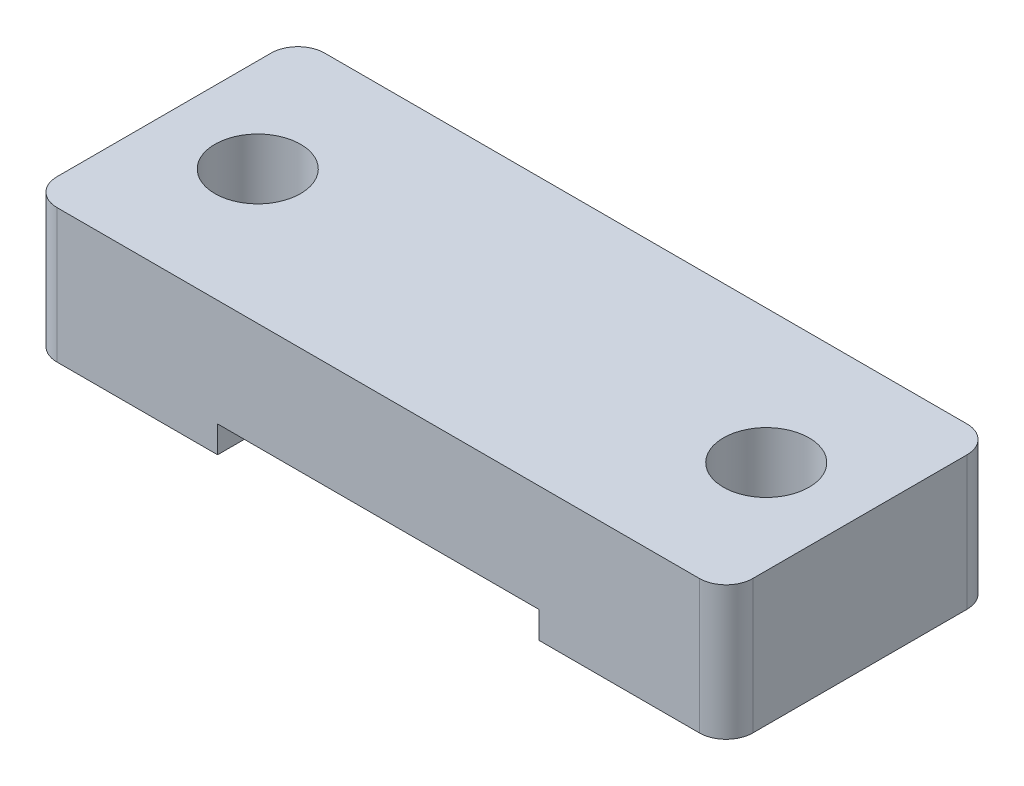
ISO-10303-21;
HEADER;
FILE_DESCRIPTION(('STEP AP214'),'2;1');
FILE_NAME('part.step','',(''),(''),'','','');
FILE_SCHEMA(('AUTOMOTIVE_DESIGN { 1 0 10303 214 1 1 1 1 }'));
ENDSEC;
DATA;
#1=APPLICATION_CONTEXT('core data for automotive mechanical design processes');
#2=APPLICATION_PROTOCOL_DEFINITION('international standard','automotive_design',2000,#1);
#3=PRODUCT_CONTEXT('',#1,'mechanical');
#4=PRODUCT('Part','Part','',(#3));
#5=PRODUCT_RELATED_PRODUCT_CATEGORY('part','',(#4));
#6=PRODUCT_DEFINITION_FORMATION('','',#4);
#7=PRODUCT_DEFINITION_CONTEXT('part definition',#1,'design');
#8=PRODUCT_DEFINITION('design','',#6,#7);
#9=PRODUCT_DEFINITION_SHAPE('','',#8);
#10=(LENGTH_UNIT() NAMED_UNIT(*) SI_UNIT(.MILLI.,.METRE.));
#11=(NAMED_UNIT(*) PLANE_ANGLE_UNIT() SI_UNIT($,.RADIAN.));
#12=(NAMED_UNIT(*) SI_UNIT($,.STERADIAN.) SOLID_ANGLE_UNIT());
#13=UNCERTAINTY_MEASURE_WITH_UNIT(LENGTH_MEASURE(1.E-05),#10,'distance_accuracy_value','');
#14=(GEOMETRIC_REPRESENTATION_CONTEXT(3) GLOBAL_UNCERTAINTY_ASSIGNED_CONTEXT((#13)) GLOBAL_UNIT_ASSIGNED_CONTEXT((#10,
#11,#12)) REPRESENTATION_CONTEXT('',''));
#15=CARTESIAN_POINT('',(0.,0.,0.));
#16=DIRECTION('',(0.,0.,1.));
#17=DIRECTION('',(1.,0.,0.));
#18=AXIS2_PLACEMENT_3D('',#15,#16,#17);
#19=CARTESIAN_POINT('',(0.,0.,0.));
#20=DIRECTION('',(0.,1.,0.));
#21=DIRECTION('',(0.,0.,1.));
#22=AXIS2_PLACEMENT_3D('',#19,#20,#21);
#23=PLANE('',#22);
#24=DIRECTION('',(0.,0.,1.));
#25=VECTOR('',#24,1.);
#26=CARTESIAN_POINT('',(-6.,0.,-5.));
#27=LINE('',#26,#25);
#28=CARTESIAN_POINT('',(-6.,0.,-5.));
#29=VERTEX_POINT('',#28);
#30=CARTESIAN_POINT('',(-6.,0.,5.));
#31=VERTEX_POINT('',#30);
#32=EDGE_CURVE('E148',#29,#31,#27,.T.);
#33=ORIENTED_EDGE('',*,*,#32,.F.);
#34=DIRECTION('',(-1.,0.,0.));
#35=VECTOR('',#34,1.);
#36=CARTESIAN_POINT('',(-13.,0.,-5.));
#37=LINE('',#36,#35);
#38=CARTESIAN_POINT('',(6.,0.,-5.));
#39=VERTEX_POINT('',#38);
#40=EDGE_CURVE('E134',#39,#29,#37,.T.);
#41=ORIENTED_EDGE('',*,*,#40,.F.);
#42=DIRECTION('',(0.,0.,-1.));
#43=VECTOR('',#42,1.);
#44=CARTESIAN_POINT('',(6.,0.,-5.));
#45=LINE('',#44,#43);
#46=CARTESIAN_POINT('',(6.,0.,5.));
#47=VERTEX_POINT('',#46);
#48=EDGE_CURVE('E138',#47,#39,#45,.T.);
#49=ORIENTED_EDGE('',*,*,#48,.F.);
#50=DIRECTION('',(1.,0.,0.));
#51=VECTOR('',#50,1.);
#52=CARTESIAN_POINT('',(-13.,0.,5.));
#53=LINE('',#52,#51);
#54=EDGE_CURVE('E173',#31,#47,#53,.T.);
#55=ORIENTED_EDGE('',*,*,#54,.F.);
#56=EDGE_LOOP('',(#33,#41,#49,#55));
#57=FACE_BOUND('',#56,.T.);
#58=ADVANCED_FACE('F35',(#57),#23,.F.);
#59=CARTESIAN_POINT('',(13.,4.,-5.));
#60=DIRECTION('',(-1.,0.,0.));
#61=DIRECTION('',(0.,0.,1.));
#62=AXIS2_PLACEMENT_3D('',#59,#60,#61);
#63=PLANE('',#62);
#64=DIRECTION('',(0.,0.,-1.));
#65=VECTOR('',#64,1.);
#66=CARTESIAN_POINT('',(13.,4.,-5.));
#67=LINE('',#66,#65);
#68=CARTESIAN_POINT('',(13.,4.,4.));
#69=VERTEX_POINT('',#68);
#70=CARTESIAN_POINT('',(13.,4.,-4.));
#71=VERTEX_POINT('',#70);
#72=EDGE_CURVE('E169',#69,#71,#67,.T.);
#73=ORIENTED_EDGE('',*,*,#72,.F.);
#74=DIRECTION('',(0.,-1.,0.));
#75=VECTOR('',#74,1.);
#76=CARTESIAN_POINT('',(13.,4.,4.));
#77=LINE('',#76,#75);
#78=CARTESIAN_POINT('',(13.,-1.,4.));
#79=VERTEX_POINT('',#78);
#80=EDGE_CURVE('E186',#69,#79,#77,.T.);
#81=ORIENTED_EDGE('',*,*,#80,.T.);
#82=DIRECTION('',(0.,0.,1.));
#83=VECTOR('',#82,1.);
#84=CARTESIAN_POINT('',(13.,-1.,-5.));
#85=LINE('',#84,#83);
#86=CARTESIAN_POINT('',(13.,-1.,-4.));
#87=VERTEX_POINT('',#86);
#88=EDGE_CURVE('E152',#87,#79,#85,.T.);
#89=ORIENTED_EDGE('',*,*,#88,.F.);
#90=DIRECTION('',(0.,-1.,0.));
#91=VECTOR('',#90,1.);
#92=CARTESIAN_POINT('',(13.,4.,-4.));
#93=LINE('',#92,#91);
#94=EDGE_CURVE('E182',#87,#71,#93,.F.);
#95=ORIENTED_EDGE('',*,*,#94,.T.);
#96=EDGE_LOOP('',(#73,#81,#89,#95));
#97=FACE_BOUND('',#96,.T.);
#98=ADVANCED_FACE('F251',(#97),#63,.F.);
#99=CARTESIAN_POINT('',(-13.,4.,-5.));
#100=DIRECTION('',(0.,0.,1.));
#101=DIRECTION('',(1.,0.,0.));
#102=AXIS2_PLACEMENT_3D('',#99,#100,#101);
#103=PLANE('',#102);
#104=DIRECTION('',(1.,0.,0.));
#105=VECTOR('',#104,1.);
#106=CARTESIAN_POINT('',(-13.,-1.,-5.));
#107=LINE('',#106,#105);
#108=CARTESIAN_POINT('',(-12.,-1.,-5.));
#109=VERTEX_POINT('',#108);
#110=CARTESIAN_POINT('',(-6.,-1.,-5.));
#111=VERTEX_POINT('',#110);
#112=EDGE_CURVE('E120',#109,#111,#107,.T.);
#113=ORIENTED_EDGE('',*,*,#112,.F.);
#114=DIRECTION('',(0.,-1.,0.));
#115=VECTOR('',#114,1.);
#116=CARTESIAN_POINT('',(-12.,4.,-5.));
#117=LINE('',#116,#115);
#118=CARTESIAN_POINT('',(-12.,4.,-5.));
#119=VERTEX_POINT('',#118);
#120=EDGE_CURVE('E11',#109,#119,#117,.F.);
#121=ORIENTED_EDGE('',*,*,#120,.T.);
#122=DIRECTION('',(-1.,0.,0.));
#123=VECTOR('',#122,1.);
#124=CARTESIAN_POINT('',(-13.,4.,-5.));
#125=LINE('',#124,#123);
#126=CARTESIAN_POINT('',(12.,4.,-5.));
#127=VERTEX_POINT('',#126);
#128=EDGE_CURVE('E172',#127,#119,#125,.T.);
#129=ORIENTED_EDGE('',*,*,#128,.F.);
#130=DIRECTION('',(0.,-1.,0.));
#131=VECTOR('',#130,1.);
#132=CARTESIAN_POINT('',(12.,4.,-5.));
#133=LINE('',#132,#131);
#134=CARTESIAN_POINT('',(12.,-1.,-5.));
#135=VERTEX_POINT('',#134);
#136=EDGE_CURVE('E43',#127,#135,#133,.T.);
#137=ORIENTED_EDGE('',*,*,#136,.T.);
#138=DIRECTION('',(1.,0.,0.));
#139=VECTOR('',#138,1.);
#140=CARTESIAN_POINT('',(13.,-1.,-5.));
#141=LINE('',#140,#139);
#142=CARTESIAN_POINT('',(6.,-1.,-5.));
#143=VERTEX_POINT('',#142);
#144=EDGE_CURVE('E159',#143,#135,#141,.T.);
#145=ORIENTED_EDGE('',*,*,#144,.F.);
#146=DIRECTION('',(0.,1.,0.));
#147=VECTOR('',#146,1.);
#148=CARTESIAN_POINT('',(6.,-1.,-5.));
#149=LINE('',#148,#147);
#150=EDGE_CURVE('E162',#143,#39,#149,.T.);
#151=ORIENTED_EDGE('',*,*,#150,.T.);
#152=ORIENTED_EDGE('',*,*,#40,.T.);
#153=DIRECTION('',(0.,1.,0.));
#154=VECTOR('',#153,1.);
#155=CARTESIAN_POINT('',(-6.,-1.,-5.));
#156=LINE('',#155,#154);
#157=EDGE_CURVE('E131',#111,#29,#156,.T.);
#158=ORIENTED_EDGE('',*,*,#157,.F.);
#159=EDGE_LOOP('',(#113,#121,#129,#137,#145,#151,#152,#158));
#160=FACE_BOUND('',#159,.T.);
#161=ADVANCED_FACE('F132',(#160),#103,.F.);
#162=CARTESIAN_POINT('',(-13.,4.,-5.));
#163=DIRECTION('',(1.,0.,0.));
#164=DIRECTION('',(0.,0.,-1.));
#165=AXIS2_PLACEMENT_3D('',#162,#163,#164);
#166=PLANE('',#165);
#167=DIRECTION('',(0.,0.,-1.));
#168=VECTOR('',#167,1.);
#169=CARTESIAN_POINT('',(-13.,-1.,-5.));
#170=LINE('',#169,#168);
#171=CARTESIAN_POINT('',(-13.,-1.,4.));
#172=VERTEX_POINT('',#171);
#173=CARTESIAN_POINT('',(-13.,-1.,-4.));
#174=VERTEX_POINT('',#173);
#175=EDGE_CURVE('E128',#172,#174,#170,.T.);
#176=ORIENTED_EDGE('',*,*,#175,.F.);
#177=DIRECTION('',(0.,-1.,0.));
#178=VECTOR('',#177,1.);
#179=CARTESIAN_POINT('',(-13.,4.,4.));
#180=LINE('',#179,#178);
#181=CARTESIAN_POINT('',(-13.,4.,4.));
#182=VERTEX_POINT('',#181);
#183=EDGE_CURVE('E211',#172,#182,#180,.F.);
#184=ORIENTED_EDGE('',*,*,#183,.T.);
#185=DIRECTION('',(0.,0.,1.));
#186=VECTOR('',#185,1.);
#187=CARTESIAN_POINT('',(-13.,4.,-5.));
#188=LINE('',#187,#186);
#189=CARTESIAN_POINT('',(-13.,4.,-4.));
#190=VERTEX_POINT('',#189);
#191=EDGE_CURVE('E176',#190,#182,#188,.T.);
#192=ORIENTED_EDGE('',*,*,#191,.F.);
#193=DIRECTION('',(0.,-1.,0.));
#194=VECTOR('',#193,1.);
#195=CARTESIAN_POINT('',(-13.,4.,-4.));
#196=LINE('',#195,#194);
#197=EDGE_CURVE('E209',#190,#174,#196,.T.);
#198=ORIENTED_EDGE('',*,*,#197,.T.);
#199=EDGE_LOOP('',(#176,#184,#192,#198));
#200=FACE_BOUND('',#199,.T.);
#201=ADVANCED_FACE('F238',(#200),#166,.F.);
#202=CARTESIAN_POINT('',(-13.,4.,5.));
#203=DIRECTION('',(0.,0.,-1.));
#204=DIRECTION('',(-1.,0.,0.));
#205=AXIS2_PLACEMENT_3D('',#202,#203,#204);
#206=PLANE('',#205);
#207=DIRECTION('',(-1.,0.,0.));
#208=VECTOR('',#207,1.);
#209=CARTESIAN_POINT('',(13.,-1.,5.));
#210=LINE('',#209,#208);
#211=CARTESIAN_POINT('',(12.,-1.,5.));
#212=VERTEX_POINT('',#211);
#213=CARTESIAN_POINT('',(6.,-1.,5.));
#214=VERTEX_POINT('',#213);
#215=EDGE_CURVE('E155',#212,#214,#210,.T.);
#216=ORIENTED_EDGE('',*,*,#215,.F.);
#217=DIRECTION('',(0.,-1.,0.));
#218=VECTOR('',#217,1.);
#219=CARTESIAN_POINT('',(12.,4.,5.));
#220=LINE('',#219,#218);
#221=CARTESIAN_POINT('',(12.,4.,5.));
#222=VERTEX_POINT('',#221);
#223=EDGE_CURVE('E196',#212,#222,#220,.F.);
#224=ORIENTED_EDGE('',*,*,#223,.T.);
#225=DIRECTION('',(1.,0.,0.));
#226=VECTOR('',#225,1.);
#227=CARTESIAN_POINT('',(-13.,4.,5.));
#228=LINE('',#227,#226);
#229=CARTESIAN_POINT('',(-12.,4.,5.));
#230=VERTEX_POINT('',#229);
#231=EDGE_CURVE('E179',#230,#222,#228,.T.);
#232=ORIENTED_EDGE('',*,*,#231,.F.);
#233=DIRECTION('',(0.,-1.,0.));
#234=VECTOR('',#233,1.);
#235=CARTESIAN_POINT('',(-12.,4.,5.));
#236=LINE('',#235,#234);
#237=CARTESIAN_POINT('',(-12.,-1.,5.));
#238=VERTEX_POINT('',#237);
#239=EDGE_CURVE('E193',#230,#238,#236,.T.);
#240=ORIENTED_EDGE('',*,*,#239,.T.);
#241=DIRECTION('',(-1.,0.,0.));
#242=VECTOR('',#241,1.);
#243=CARTESIAN_POINT('',(-13.,-1.,5.));
#244=LINE('',#243,#242);
#245=CARTESIAN_POINT('',(-6.,-1.,5.));
#246=VERTEX_POINT('',#245);
#247=EDGE_CURVE('E143',#246,#238,#244,.T.);
#248=ORIENTED_EDGE('',*,*,#247,.F.);
#249=DIRECTION('',(0.,1.,0.));
#250=VECTOR('',#249,1.);
#251=CARTESIAN_POINT('',(-6.,-1.,5.));
#252=LINE('',#251,#250);
#253=EDGE_CURVE('E139',#246,#31,#252,.T.);
#254=ORIENTED_EDGE('',*,*,#253,.T.);
#255=ORIENTED_EDGE('',*,*,#54,.T.);
#256=DIRECTION('',(0.,1.,0.));
#257=VECTOR('',#256,1.);
#258=CARTESIAN_POINT('',(6.,-1.,5.));
#259=LINE('',#258,#257);
#260=EDGE_CURVE('E166',#214,#47,#259,.T.);
#261=ORIENTED_EDGE('',*,*,#260,.F.);
#262=EDGE_LOOP('',(#216,#224,#232,#240,#248,#254,#255,#261));
#263=FACE_BOUND('',#262,.T.);
#264=ADVANCED_FACE('F231',(#263),#206,.F.);
#265=CARTESIAN_POINT('',(0.,4.,0.));
#266=DIRECTION('',(0.,1.,0.));
#267=DIRECTION('',(0.,0.,1.));
#268=AXIS2_PLACEMENT_3D('',#265,#266,#267);
#269=PLANE('',#268);
#270=CARTESIAN_POINT('',(9.5,4.,0.));
#271=DIRECTION('',(0.,-1.,0.));
#272=DIRECTION('',(0.,0.,-1.));
#273=AXIS2_PLACEMENT_3D('',#270,#271,#272);
#274=CIRCLE('',#273,1.6);
#275=CARTESIAN_POINT('',(9.5,4.,-1.6));
#276=VERTEX_POINT('',#275);
#277=EDGE_CURVE('E150',#276,#276,#274,.T.);
#278=ORIENTED_EDGE('',*,*,#277,.T.);
#279=EDGE_LOOP('',(#278));
#280=FACE_BOUND('',#279,.T.);
#281=CARTESIAN_POINT('',(-9.5,4.,0.));
#282=DIRECTION('',(0.,-1.,0.));
#283=DIRECTION('',(0.,0.,1.));
#284=AXIS2_PLACEMENT_3D('',#281,#282,#283);
#285=CIRCLE('',#284,1.6);
#286=CARTESIAN_POINT('',(-9.5,4.,1.6));
#287=VERTEX_POINT('',#286);
#288=EDGE_CURVE('E312',#287,#287,#285,.T.);
#289=ORIENTED_EDGE('',*,*,#288,.T.);
#290=EDGE_LOOP('',(#289));
#291=FACE_BOUND('',#290,.T.);
#292=ORIENTED_EDGE('',*,*,#231,.T.);
#293=CARTESIAN_POINT('',(12.,4.,4.));
#294=DIRECTION('',(0.,1.,0.));
#295=DIRECTION('',(0.,0.,1.));
#296=AXIS2_PLACEMENT_3D('',#293,#294,#295);
#297=CIRCLE('',#296,1.);
#298=EDGE_CURVE('E204',#222,#69,#297,.T.);
#299=ORIENTED_EDGE('',*,*,#298,.T.);
#300=ORIENTED_EDGE('',*,*,#72,.T.);
#301=CARTESIAN_POINT('',(12.,4.,-4.));
#302=DIRECTION('',(0.,1.,0.));
#303=DIRECTION('',(0.,0.,1.));
#304=AXIS2_PLACEMENT_3D('',#301,#302,#303);
#305=CIRCLE('',#304,1.);
#306=EDGE_CURVE('E198',#71,#127,#305,.T.);
#307=ORIENTED_EDGE('',*,*,#306,.T.);
#308=ORIENTED_EDGE('',*,*,#128,.T.);
#309=CARTESIAN_POINT('',(-12.,4.,-4.));
#310=DIRECTION('',(0.,1.,0.));
#311=DIRECTION('',(0.,0.,1.));
#312=AXIS2_PLACEMENT_3D('',#309,#310,#311);
#313=CIRCLE('',#312,1.);
#314=EDGE_CURVE('E200',#119,#190,#313,.T.);
#315=ORIENTED_EDGE('',*,*,#314,.T.);
#316=ORIENTED_EDGE('',*,*,#191,.T.);
#317=CARTESIAN_POINT('',(-12.,4.,4.));
#318=DIRECTION('',(0.,1.,0.));
#319=DIRECTION('',(0.,0.,1.));
#320=AXIS2_PLACEMENT_3D('',#317,#318,#319);
#321=CIRCLE('',#320,1.);
#322=EDGE_CURVE('E202',#182,#230,#321,.T.);
#323=ORIENTED_EDGE('',*,*,#322,.T.);
#324=EDGE_LOOP('',(#292,#299,#300,#307,#308,#315,#316,#323));
#325=FACE_BOUND('',#324,.T.);
#326=ADVANCED_FACE('F243',(#280,#291,#325),#269,.T.);
#327=CARTESIAN_POINT('',(6.,-1.,-5.));
#328=DIRECTION('',(1.,0.,0.));
#329=DIRECTION('',(0.,0.,-1.));
#330=AXIS2_PLACEMENT_3D('',#327,#328,#329);
#331=PLANE('',#330);
#332=ORIENTED_EDGE('',*,*,#48,.T.);
#333=ORIENTED_EDGE('',*,*,#150,.F.);
#334=DIRECTION('',(0.,0.,-1.));
#335=VECTOR('',#334,1.);
#336=CARTESIAN_POINT('',(6.,-1.,-5.));
#337=LINE('',#336,#335);
#338=EDGE_CURVE('E157',#214,#143,#337,.T.);
#339=ORIENTED_EDGE('',*,*,#338,.F.);
#340=ORIENTED_EDGE('',*,*,#260,.T.);
#341=EDGE_LOOP('',(#332,#333,#339,#340));
#342=FACE_BOUND('',#341,.T.);
#343=ADVANCED_FACE('F226',(#342),#331,.F.);
#344=CARTESIAN_POINT('',(0.,-1.,0.));
#345=DIRECTION('',(0.,-1.,0.));
#346=DIRECTION('',(0.,0.,-1.));
#347=AXIS2_PLACEMENT_3D('',#344,#345,#346);
#348=PLANE('',#347);
#349=CARTESIAN_POINT('',(9.5,-1.,0.));
#350=DIRECTION('',(0.,-1.,0.));
#351=DIRECTION('',(0.,0.,-1.));
#352=AXIS2_PLACEMENT_3D('',#349,#350,#351);
#353=CIRCLE('',#352,1.6);
#354=CARTESIAN_POINT('',(9.5,-1.,-1.6));
#355=VERTEX_POINT('',#354);
#356=EDGE_CURVE('E313',#355,#355,#353,.T.);
#357=ORIENTED_EDGE('',*,*,#356,.F.);
#358=EDGE_LOOP('',(#357));
#359=FACE_BOUND('',#358,.T.);
#360=ORIENTED_EDGE('',*,*,#88,.T.);
#361=CARTESIAN_POINT('',(12.,-1.,4.));
#362=DIRECTION('',(0.,-1.,0.));
#363=DIRECTION('',(0.,0.,-1.));
#364=AXIS2_PLACEMENT_3D('',#361,#362,#363);
#365=CIRCLE('',#364,1.);
#366=EDGE_CURVE('E191',#79,#212,#365,.T.);
#367=ORIENTED_EDGE('',*,*,#366,.T.);
#368=ORIENTED_EDGE('',*,*,#215,.T.);
#369=ORIENTED_EDGE('',*,*,#338,.T.);
#370=ORIENTED_EDGE('',*,*,#144,.T.);
#371=CARTESIAN_POINT('',(12.,-1.,-4.));
#372=DIRECTION('',(0.,-1.,0.));
#373=DIRECTION('',(0.,0.,-1.));
#374=AXIS2_PLACEMENT_3D('',#371,#372,#373);
#375=CIRCLE('',#374,1.);
#376=EDGE_CURVE('E189',#135,#87,#375,.T.);
#377=ORIENTED_EDGE('',*,*,#376,.T.);
#378=EDGE_LOOP('',(#360,#367,#368,#369,#370,#377));
#379=FACE_BOUND('',#378,.T.);
#380=ADVANCED_FACE('F219',(#359,#379),#348,.T.);
#381=CARTESIAN_POINT('',(-6.,-1.,-5.));
#382=DIRECTION('',(-1.,0.,0.));
#383=DIRECTION('',(0.,0.,1.));
#384=AXIS2_PLACEMENT_3D('',#381,#382,#383);
#385=PLANE('',#384);
#386=ORIENTED_EDGE('',*,*,#32,.T.);
#387=ORIENTED_EDGE('',*,*,#253,.F.);
#388=DIRECTION('',(0.,0.,1.));
#389=VECTOR('',#388,1.);
#390=CARTESIAN_POINT('',(-6.,-1.,-5.));
#391=LINE('',#390,#389);
#392=EDGE_CURVE('E125',#111,#246,#391,.T.);
#393=ORIENTED_EDGE('',*,*,#392,.F.);
#394=ORIENTED_EDGE('',*,*,#157,.T.);
#395=EDGE_LOOP('',(#386,#387,#393,#394));
#396=FACE_BOUND('',#395,.T.);
#397=ADVANCED_FACE('F141',(#396),#385,.F.);
#398=CARTESIAN_POINT('',(0.,-1.,0.));
#399=DIRECTION('',(0.,1.,0.));
#400=DIRECTION('',(0.,0.,1.));
#401=AXIS2_PLACEMENT_3D('',#398,#399,#400);
#402=PLANE('',#401);
#403=CARTESIAN_POINT('',(-9.5,-1.,0.));
#404=DIRECTION('',(0.,-1.,0.));
#405=DIRECTION('',(0.,0.,1.));
#406=AXIS2_PLACEMENT_3D('',#403,#404,#405);
#407=CIRCLE('',#406,1.6);
#408=CARTESIAN_POINT('',(-9.5,-1.,1.6));
#409=VERTEX_POINT('',#408);
#410=EDGE_CURVE('E314',#409,#409,#407,.T.);
#411=ORIENTED_EDGE('',*,*,#410,.F.);
#412=EDGE_LOOP('',(#411));
#413=FACE_BOUND('',#412,.T.);
#414=ORIENTED_EDGE('',*,*,#247,.T.);
#415=CARTESIAN_POINT('',(-12.,-1.,4.));
#416=DIRECTION('',(0.,1.,0.));
#417=DIRECTION('',(0.,0.,1.));
#418=AXIS2_PLACEMENT_3D('',#415,#416,#417);
#419=CIRCLE('',#418,1.);
#420=EDGE_CURVE('E207',#238,#172,#419,.F.);
#421=ORIENTED_EDGE('',*,*,#420,.T.);
#422=ORIENTED_EDGE('',*,*,#175,.T.);
#423=CARTESIAN_POINT('',(-12.,-1.,-4.));
#424=DIRECTION('',(0.,1.,0.));
#425=DIRECTION('',(0.,0.,1.));
#426=AXIS2_PLACEMENT_3D('',#423,#424,#425);
#427=CIRCLE('',#426,1.);
#428=EDGE_CURVE('E50',#174,#109,#427,.F.);
#429=ORIENTED_EDGE('',*,*,#428,.T.);
#430=ORIENTED_EDGE('',*,*,#112,.T.);
#431=ORIENTED_EDGE('',*,*,#392,.T.);
#432=EDGE_LOOP('',(#414,#421,#422,#429,#430,#431));
#433=FACE_BOUND('',#432,.T.);
#434=ADVANCED_FACE('F123',(#413,#433),#402,.F.);
#435=CARTESIAN_POINT('',(-9.5,4.,0.));
#436=DIRECTION('',(0.,-1.,0.));
#437=DIRECTION('',(0.,0.,-1.));
#438=AXIS2_PLACEMENT_3D('',#435,#436,#437);
#439=CYLINDRICAL_SURFACE('',#438,1.6);
#440=ORIENTED_EDGE('',*,*,#288,.F.);
#441=EDGE_LOOP('',(#440));
#442=FACE_BOUND('',#441,.T.);
#443=ORIENTED_EDGE('',*,*,#410,.T.);
#444=EDGE_LOOP('',(#443));
#445=FACE_BOUND('',#444,.T.);
#446=ADVANCED_FACE('F282',(#442,#445),#439,.F.);
#447=CARTESIAN_POINT('',(9.5,4.,0.));
#448=DIRECTION('',(0.,-1.,0.));
#449=DIRECTION('',(0.,0.,-1.));
#450=AXIS2_PLACEMENT_3D('',#447,#448,#449);
#451=CYLINDRICAL_SURFACE('',#450,1.6);
#452=ORIENTED_EDGE('',*,*,#277,.F.);
#453=EDGE_LOOP('',(#452));
#454=FACE_BOUND('',#453,.T.);
#455=ORIENTED_EDGE('',*,*,#356,.T.);
#456=EDGE_LOOP('',(#455));
#457=FACE_BOUND('',#456,.T.);
#458=ADVANCED_FACE('F278',(#454,#457),#451,.F.);
#459=CARTESIAN_POINT('',(12.,4.,4.));
#460=DIRECTION('',(0.,-1.,0.));
#461=DIRECTION('',(0.,0.,-1.));
#462=AXIS2_PLACEMENT_3D('',#459,#460,#461);
#463=CYLINDRICAL_SURFACE('',#462,1.);
#464=ORIENTED_EDGE('',*,*,#298,.F.);
#465=ORIENTED_EDGE('',*,*,#223,.F.);
#466=ORIENTED_EDGE('',*,*,#366,.F.);
#467=ORIENTED_EDGE('',*,*,#80,.F.);
#468=EDGE_LOOP('',(#464,#465,#466,#467));
#469=FACE_BOUND('',#468,.T.);
#470=ADVANCED_FACE('F247',(#469),#463,.T.);
#471=CARTESIAN_POINT('',(-12.,4.,4.));
#472=DIRECTION('',(0.,-1.,0.));
#473=DIRECTION('',(0.,0.,-1.));
#474=AXIS2_PLACEMENT_3D('',#471,#472,#473);
#475=CYLINDRICAL_SURFACE('',#474,1.);
#476=ORIENTED_EDGE('',*,*,#322,.F.);
#477=ORIENTED_EDGE('',*,*,#183,.F.);
#478=ORIENTED_EDGE('',*,*,#420,.F.);
#479=ORIENTED_EDGE('',*,*,#239,.F.);
#480=EDGE_LOOP('',(#476,#477,#478,#479));
#481=FACE_BOUND('',#480,.T.);
#482=ADVANCED_FACE('F241',(#481),#475,.T.);
#483=CARTESIAN_POINT('',(-12.,4.,-4.));
#484=DIRECTION('',(0.,-1.,0.));
#485=DIRECTION('',(0.,0.,-1.));
#486=AXIS2_PLACEMENT_3D('',#483,#484,#485);
#487=CYLINDRICAL_SURFACE('',#486,1.);
#488=ORIENTED_EDGE('',*,*,#314,.F.);
#489=ORIENTED_EDGE('',*,*,#120,.F.);
#490=ORIENTED_EDGE('',*,*,#428,.F.);
#491=ORIENTED_EDGE('',*,*,#197,.F.);
#492=EDGE_LOOP('',(#488,#489,#490,#491));
#493=FACE_BOUND('',#492,.T.);
#494=ADVANCED_FACE('F254',(#493),#487,.T.);
#495=CARTESIAN_POINT('',(12.,4.,-4.));
#496=DIRECTION('',(0.,-1.,0.));
#497=DIRECTION('',(0.,0.,-1.));
#498=AXIS2_PLACEMENT_3D('',#495,#496,#497);
#499=CYLINDRICAL_SURFACE('',#498,1.);
#500=ORIENTED_EDGE('',*,*,#306,.F.);
#501=ORIENTED_EDGE('',*,*,#94,.F.);
#502=ORIENTED_EDGE('',*,*,#376,.F.);
#503=ORIENTED_EDGE('',*,*,#136,.F.);
#504=EDGE_LOOP('',(#500,#501,#502,#503));
#505=FACE_BOUND('',#504,.T.);
#506=ADVANCED_FACE('F37',(#505),#499,.T.);
#507=CLOSED_SHELL('',(#58,#98,#161,#201,#264,#326,#343,#380,#397,#434,#446,#458,#470,#482,#494,#506));
#508=MANIFOLD_SOLID_BREP('B2',#507);
#509=ADVANCED_BREP_SHAPE_REPRESENTATION('',(#18,#508),#14);
#510=SHAPE_DEFINITION_REPRESENTATION(#9,#509);
ENDSEC;
END-ISO-10303-21;
